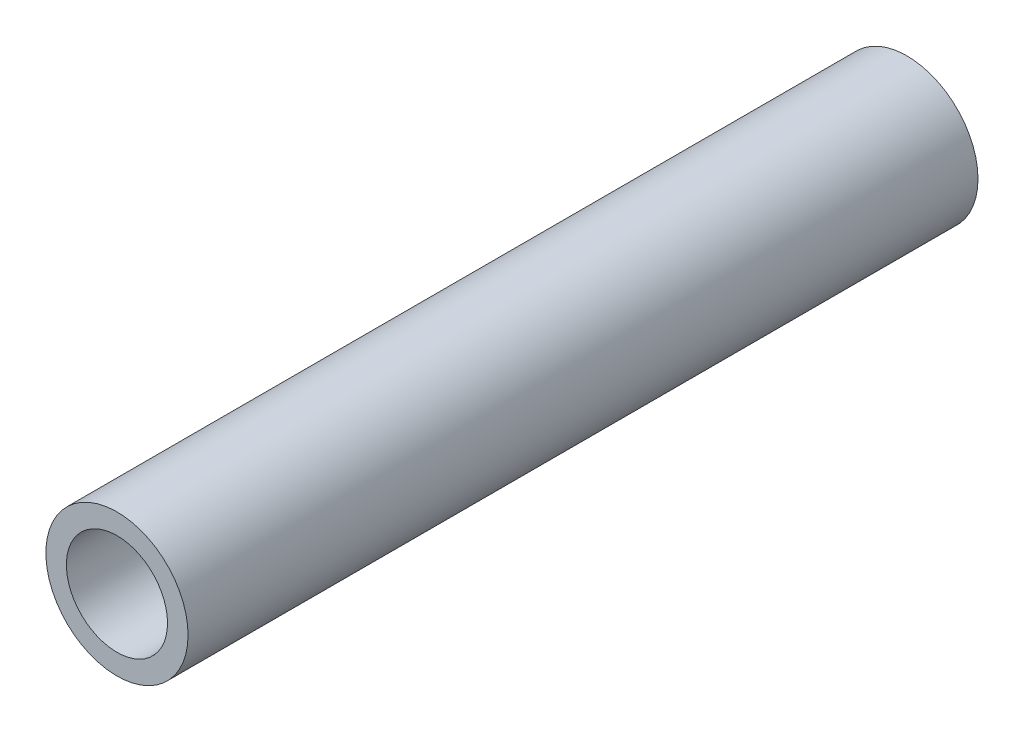
ISO-10303-21;
HEADER;
FILE_DESCRIPTION(('STEP AP214'),'2;1');
FILE_NAME('part.step','',(''),(''),'','','');
FILE_SCHEMA(('AUTOMOTIVE_DESIGN { 1 0 10303 214 1 1 1 1 }'));
ENDSEC;
DATA;
#1=APPLICATION_CONTEXT('core data for automotive mechanical design processes');
#2=APPLICATION_PROTOCOL_DEFINITION('international standard','automotive_design',2000,#1);
#3=PRODUCT_CONTEXT('',#1,'mechanical');
#4=PRODUCT('Part','Part','',(#3));
#5=PRODUCT_RELATED_PRODUCT_CATEGORY('part','',(#4));
#6=PRODUCT_DEFINITION_FORMATION('','',#4);
#7=PRODUCT_DEFINITION_CONTEXT('part definition',#1,'design');
#8=PRODUCT_DEFINITION('design','',#6,#7);
#9=PRODUCT_DEFINITION_SHAPE('','',#8);
#10=(LENGTH_UNIT() NAMED_UNIT(*) SI_UNIT(.MILLI.,.METRE.));
#11=(NAMED_UNIT(*) PLANE_ANGLE_UNIT() SI_UNIT($,.RADIAN.));
#12=(NAMED_UNIT(*) SI_UNIT($,.STERADIAN.) SOLID_ANGLE_UNIT());
#13=UNCERTAINTY_MEASURE_WITH_UNIT(LENGTH_MEASURE(1.E-05),#10,'distance_accuracy_value','');
#14=(GEOMETRIC_REPRESENTATION_CONTEXT(3) GLOBAL_UNCERTAINTY_ASSIGNED_CONTEXT((#13)) GLOBAL_UNIT_ASSIGNED_CONTEXT((#10,
#11,#12)) REPRESENTATION_CONTEXT('',''));
#15=CARTESIAN_POINT('',(0.,0.,0.));
#16=DIRECTION('',(0.,0.,1.));
#17=DIRECTION('',(1.,0.,0.));
#18=AXIS2_PLACEMENT_3D('',#15,#16,#17);
#19=CARTESIAN_POINT('',(0.,0.,12.5));
#20=DIRECTION('',(0.,0.,1.));
#21=DIRECTION('',(1.,0.,0.));
#22=AXIS2_PLACEMENT_3D('',#19,#20,#21);
#23=PLANE('',#22);
#24=CARTESIAN_POINT('',(0.,0.,12.5));
#25=DIRECTION('',(0.,0.,1.));
#26=DIRECTION('',(1.,0.,0.));
#27=AXIS2_PLACEMENT_3D('',#24,#25,#26);
#28=CIRCLE('',#27,2.25);
#29=CARTESIAN_POINT('',(2.25,0.,12.5));
#30=VERTEX_POINT('',#29);
#31=EDGE_CURVE('E10',#30,#30,#28,.T.);
#32=ORIENTED_EDGE('',*,*,#31,.T.);
#33=EDGE_LOOP('',(#32));
#34=FACE_BOUND('',#33,.T.);
#35=CARTESIAN_POINT('',(0.,0.,12.5));
#36=DIRECTION('',(0.,0.,1.));
#37=DIRECTION('',(1.,0.,0.));
#38=AXIS2_PLACEMENT_3D('',#35,#36,#37);
#39=CIRCLE('',#38,1.6);
#40=CARTESIAN_POINT('',(1.6,0.,12.5));
#41=VERTEX_POINT('',#40);
#42=EDGE_CURVE('E45',#41,#41,#39,.T.);
#43=ORIENTED_EDGE('',*,*,#42,.F.);
#44=EDGE_LOOP('',(#43));
#45=FACE_BOUND('',#44,.T.);
#46=ADVANCED_FACE('F34',(#34,#45),#23,.T.);
#47=CARTESIAN_POINT('',(0.,0.,-12.5));
#48=DIRECTION('',(0.,0.,1.));
#49=DIRECTION('',(1.,0.,0.));
#50=AXIS2_PLACEMENT_3D('',#47,#48,#49);
#51=PLANE('',#50);
#52=CARTESIAN_POINT('',(0.,0.,-12.5));
#53=DIRECTION('',(0.,0.,1.));
#54=DIRECTION('',(1.,0.,0.));
#55=AXIS2_PLACEMENT_3D('',#52,#53,#54);
#56=CIRCLE('',#55,2.25);
#57=CARTESIAN_POINT('',(2.25,0.,-12.5));
#58=VERTEX_POINT('',#57);
#59=EDGE_CURVE('E38',#58,#58,#56,.T.);
#60=ORIENTED_EDGE('',*,*,#59,.F.);
#61=EDGE_LOOP('',(#60));
#62=FACE_BOUND('',#61,.T.);
#63=CARTESIAN_POINT('',(0.,0.,-12.5));
#64=DIRECTION('',(0.,0.,1.));
#65=DIRECTION('',(1.,0.,0.));
#66=AXIS2_PLACEMENT_3D('',#63,#64,#65);
#67=CIRCLE('',#66,1.6);
#68=CARTESIAN_POINT('',(1.6,0.,-12.5));
#69=VERTEX_POINT('',#68);
#70=EDGE_CURVE('E47',#69,#69,#67,.T.);
#71=ORIENTED_EDGE('',*,*,#70,.T.);
#72=EDGE_LOOP('',(#71));
#73=FACE_BOUND('',#72,.T.);
#74=ADVANCED_FACE('F57',(#62,#73),#51,.F.);
#75=CARTESIAN_POINT('',(0.,0.,12.5));
#76=DIRECTION('',(0.,0.,-1.));
#77=DIRECTION('',(-1.,0.,0.));
#78=AXIS2_PLACEMENT_3D('',#75,#76,#77);
#79=CYLINDRICAL_SURFACE('',#78,2.25);
#80=ORIENTED_EDGE('',*,*,#31,.F.);
#81=EDGE_LOOP('',(#80));
#82=FACE_BOUND('',#81,.T.);
#83=ORIENTED_EDGE('',*,*,#59,.T.);
#84=EDGE_LOOP('',(#83));
#85=FACE_BOUND('',#84,.T.);
#86=ADVANCED_FACE('F36',(#82,#85),#79,.T.);
#87=CARTESIAN_POINT('',(0.,0.,12.5));
#88=DIRECTION('',(0.,0.,-1.));
#89=DIRECTION('',(-1.,0.,0.));
#90=AXIS2_PLACEMENT_3D('',#87,#88,#89);
#91=CYLINDRICAL_SURFACE('',#90,1.6);
#92=ORIENTED_EDGE('',*,*,#42,.T.);
#93=EDGE_LOOP('',(#92));
#94=FACE_BOUND('',#93,.T.);
#95=ORIENTED_EDGE('',*,*,#70,.F.);
#96=EDGE_LOOP('',(#95));
#97=FACE_BOUND('',#96,.T.);
#98=ADVANCED_FACE('F53',(#94,#97),#91,.F.);
#99=CLOSED_SHELL('',(#46,#74,#86,#98));
#100=MANIFOLD_SOLID_BREP('B2',#99);
#101=ADVANCED_BREP_SHAPE_REPRESENTATION('',(#18,#100),#14);
#102=SHAPE_DEFINITION_REPRESENTATION(#9,#101);
ENDSEC;
END-ISO-10303-21;
